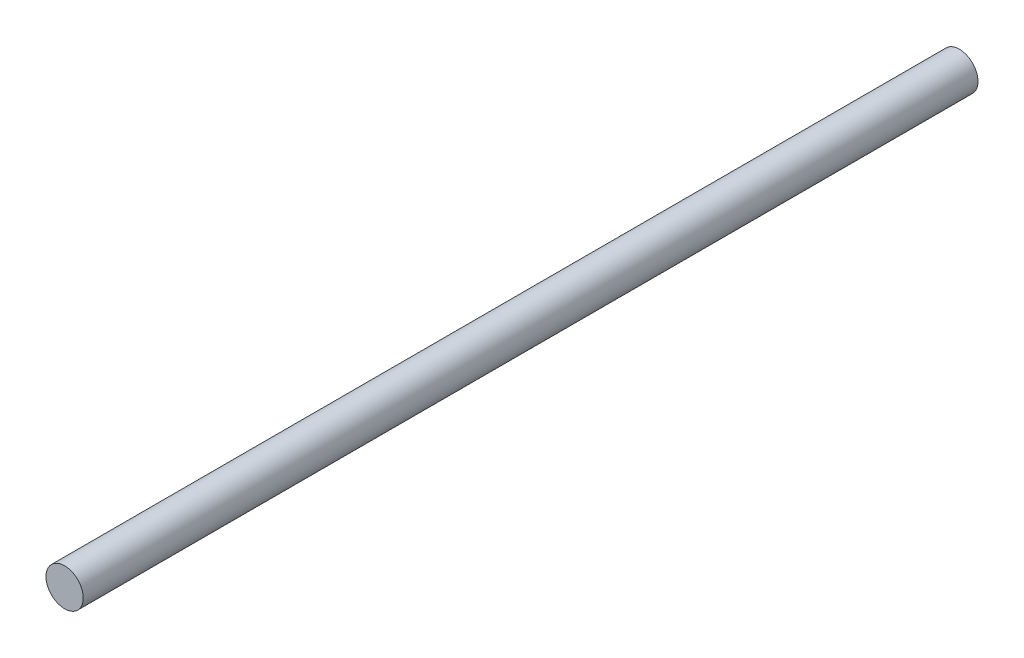
ISO-10303-21;
HEADER;
FILE_DESCRIPTION(('STEP AP214'),'2;1');
FILE_NAME('part.step','',(''),(''),'','','');
FILE_SCHEMA(('AUTOMOTIVE_DESIGN { 1 0 10303 214 1 1 1 1 }'));
ENDSEC;
DATA;
#1=APPLICATION_CONTEXT('core data for automotive mechanical design processes');
#2=APPLICATION_PROTOCOL_DEFINITION('international standard','automotive_design',2000,#1);
#3=PRODUCT_CONTEXT('',#1,'mechanical');
#4=PRODUCT('Part','Part','',(#3));
#5=PRODUCT_RELATED_PRODUCT_CATEGORY('part','',(#4));
#6=PRODUCT_DEFINITION_FORMATION('','',#4);
#7=PRODUCT_DEFINITION_CONTEXT('part definition',#1,'design');
#8=PRODUCT_DEFINITION('design','',#6,#7);
#9=PRODUCT_DEFINITION_SHAPE('','',#8);
#10=(LENGTH_UNIT() NAMED_UNIT(*) SI_UNIT(.MILLI.,.METRE.));
#11=(NAMED_UNIT(*) PLANE_ANGLE_UNIT() SI_UNIT($,.RADIAN.));
#12=(NAMED_UNIT(*) SI_UNIT($,.STERADIAN.) SOLID_ANGLE_UNIT());
#13=UNCERTAINTY_MEASURE_WITH_UNIT(LENGTH_MEASURE(1.E-05),#10,'distance_accuracy_value','');
#14=(GEOMETRIC_REPRESENTATION_CONTEXT(3) GLOBAL_UNCERTAINTY_ASSIGNED_CONTEXT((#13)) GLOBAL_UNIT_ASSIGNED_CONTEXT((#10,
#11,#12)) REPRESENTATION_CONTEXT('',''));
#15=CARTESIAN_POINT('',(0.,0.,0.));
#16=DIRECTION('',(0.,0.,1.));
#17=DIRECTION('',(1.,0.,0.));
#18=AXIS2_PLACEMENT_3D('',#15,#16,#17);
#19=CARTESIAN_POINT('',(0.,0.,152.4));
#20=DIRECTION('',(0.,0.,-1.));
#21=DIRECTION('',(-1.,0.,0.));
#22=AXIS2_PLACEMENT_3D('',#19,#20,#21);
#23=CYLINDRICAL_SURFACE('',#22,6.35);
#24=CARTESIAN_POINT('',(0.,0.,152.4));
#25=DIRECTION('',(0.,0.,1.));
#26=DIRECTION('',(1.,0.,0.));
#27=AXIS2_PLACEMENT_3D('',#24,#25,#26);
#28=CIRCLE('',#27,6.35);
#29=CARTESIAN_POINT('',(6.35,0.,152.4));
#30=VERTEX_POINT('',#29);
#31=EDGE_CURVE('E10',#30,#30,#28,.T.);
#32=ORIENTED_EDGE('',*,*,#31,.F.);
#33=EDGE_LOOP('',(#32));
#34=FACE_BOUND('',#33,.T.);
#35=CARTESIAN_POINT('',(0.,0.,-152.4));
#36=DIRECTION('',(0.,0.,1.));
#37=DIRECTION('',(1.,0.,0.));
#38=AXIS2_PLACEMENT_3D('',#35,#36,#37);
#39=CIRCLE('',#38,6.35);
#40=CARTESIAN_POINT('',(6.35,0.,-152.4));
#41=VERTEX_POINT('',#40);
#42=EDGE_CURVE('E34',#41,#41,#39,.T.);
#43=ORIENTED_EDGE('',*,*,#42,.T.);
#44=EDGE_LOOP('',(#43));
#45=FACE_BOUND('',#44,.T.);
#46=ADVANCED_FACE('F31',(#34,#45),#23,.T.);
#47=CARTESIAN_POINT('',(0.,0.,152.4));
#48=DIRECTION('',(0.,0.,1.));
#49=DIRECTION('',(1.,0.,0.));
#50=AXIS2_PLACEMENT_3D('',#47,#48,#49);
#51=PLANE('',#50);
#52=ORIENTED_EDGE('',*,*,#31,.T.);
#53=EDGE_LOOP('',(#52));
#54=FACE_BOUND('',#53,.T.);
#55=ADVANCED_FACE('F46',(#54),#51,.T.);
#56=CARTESIAN_POINT('',(0.,0.,-152.4));
#57=DIRECTION('',(0.,0.,1.));
#58=DIRECTION('',(1.,0.,0.));
#59=AXIS2_PLACEMENT_3D('',#56,#57,#58);
#60=PLANE('',#59);
#61=ORIENTED_EDGE('',*,*,#42,.F.);
#62=EDGE_LOOP('',(#61));
#63=FACE_BOUND('',#62,.T.);
#64=ADVANCED_FACE('F44',(#63),#60,.F.);
#65=CLOSED_SHELL('',(#46,#55,#64));
#66=MANIFOLD_SOLID_BREP('B2',#65);
#67=ADVANCED_BREP_SHAPE_REPRESENTATION('',(#18,#66),#14);
#68=SHAPE_DEFINITION_REPRESENTATION(#9,#67);
ENDSEC;
END-ISO-10303-21;
